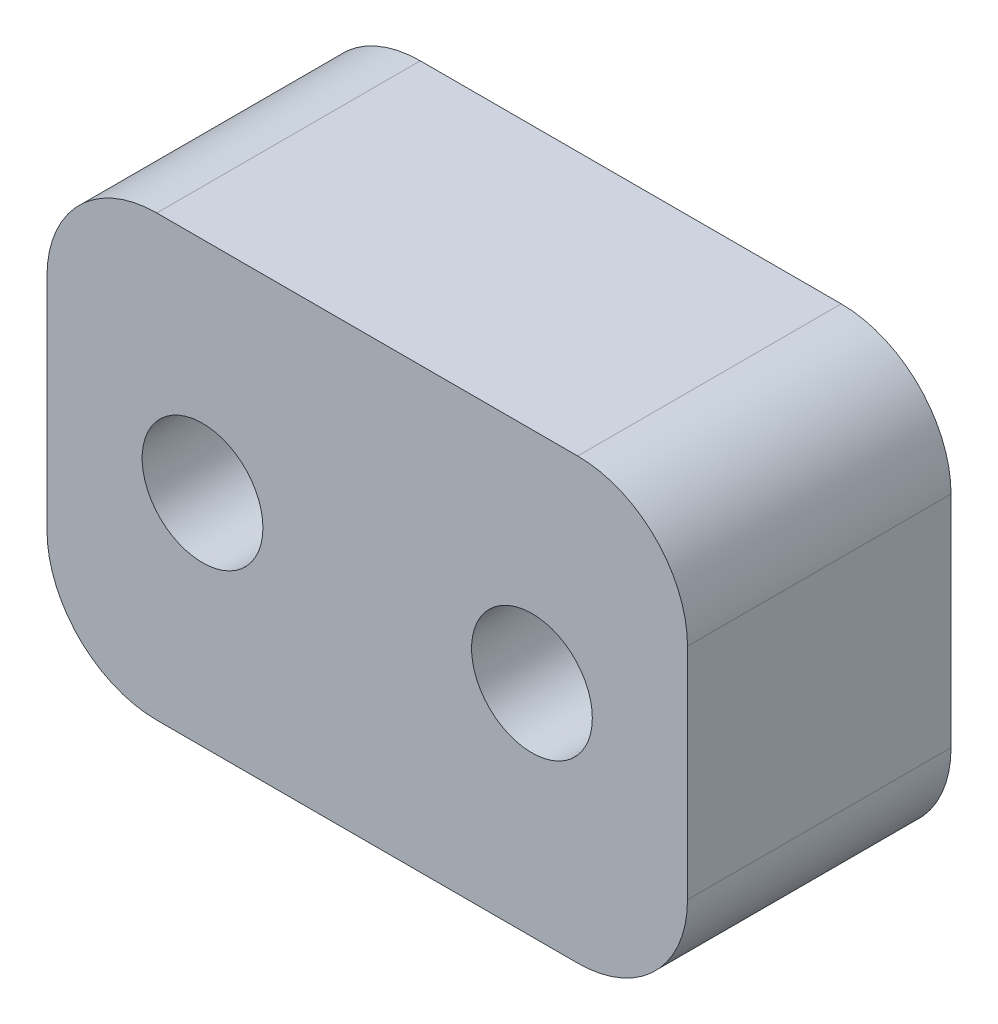
ISO-10303-21;
HEADER;
FILE_DESCRIPTION(('STEP AP214'),'2;1');
FILE_NAME('part.step','',(''),(''),'','','');
FILE_SCHEMA(('AUTOMOTIVE_DESIGN { 1 0 10303 214 1 1 1 1 }'));
ENDSEC;
DATA;
#1=APPLICATION_CONTEXT('core data for automotive mechanical design processes');
#2=APPLICATION_PROTOCOL_DEFINITION('international standard','automotive_design',2000,#1);
#3=PRODUCT_CONTEXT('',#1,'mechanical');
#4=PRODUCT('Part','Part','',(#3));
#5=PRODUCT_RELATED_PRODUCT_CATEGORY('part','',(#4));
#6=PRODUCT_DEFINITION_FORMATION('','',#4);
#7=PRODUCT_DEFINITION_CONTEXT('part definition',#1,'design');
#8=PRODUCT_DEFINITION('design','',#6,#7);
#9=PRODUCT_DEFINITION_SHAPE('','',#8);
#10=(LENGTH_UNIT() NAMED_UNIT(*) SI_UNIT(.MILLI.,.METRE.));
#11=(NAMED_UNIT(*) PLANE_ANGLE_UNIT() SI_UNIT($,.RADIAN.));
#12=(NAMED_UNIT(*) SI_UNIT($,.STERADIAN.) SOLID_ANGLE_UNIT());
#13=UNCERTAINTY_MEASURE_WITH_UNIT(LENGTH_MEASURE(1.E-05),#10,'distance_accuracy_value','');
#14=(GEOMETRIC_REPRESENTATION_CONTEXT(3) GLOBAL_UNCERTAINTY_ASSIGNED_CONTEXT((#13)) GLOBAL_UNIT_ASSIGNED_CONTEXT((#10,
#11,#12)) REPRESENTATION_CONTEXT('',''));
#15=CARTESIAN_POINT('',(0.,0.,0.));
#16=DIRECTION('',(0.,0.,1.));
#17=DIRECTION('',(1.,0.,0.));
#18=AXIS2_PLACEMENT_3D('',#15,#16,#17);
#19=CARTESIAN_POINT('',(-8.75,6.,7.2));
#20=DIRECTION('',(1.,0.,0.));
#21=DIRECTION('',(0.,1.,0.));
#22=AXIS2_PLACEMENT_3D('',#19,#20,#21);
#23=PLANE('',#22);
#24=DIRECTION('',(0.,-1.,0.));
#25=VECTOR('',#24,1.);
#26=CARTESIAN_POINT('',(-8.75,6.,0.));
#27=LINE('',#26,#25);
#28=CARTESIAN_POINT('',(-8.75,3.,0.));
#29=VERTEX_POINT('',#28);
#30=CARTESIAN_POINT('',(-8.75,-3.,0.));
#31=VERTEX_POINT('',#30);
#32=EDGE_CURVE('E165',#29,#31,#27,.T.);
#33=ORIENTED_EDGE('',*,*,#32,.T.);
#34=DIRECTION('',(0.,0.,-1.));
#35=VECTOR('',#34,1.);
#36=CARTESIAN_POINT('',(-8.75,-3.,7.2));
#37=LINE('',#36,#35);
#38=CARTESIAN_POINT('',(-8.75,-3.,7.2));
#39=VERTEX_POINT('',#38);
#40=EDGE_CURVE('E11',#31,#39,#37,.F.);
#41=ORIENTED_EDGE('',*,*,#40,.T.);
#42=DIRECTION('',(0.,-1.,0.));
#43=VECTOR('',#42,1.);
#44=CARTESIAN_POINT('',(-8.75,6.,7.2));
#45=LINE('',#44,#43);
#46=CARTESIAN_POINT('',(-8.75,3.,7.2));
#47=VERTEX_POINT('',#46);
#48=EDGE_CURVE('E133',#47,#39,#45,.T.);
#49=ORIENTED_EDGE('',*,*,#48,.F.);
#50=DIRECTION('',(0.,0.,-1.));
#51=VECTOR('',#50,1.);
#52=CARTESIAN_POINT('',(-8.75,3.,7.2));
#53=LINE('',#52,#51);
#54=EDGE_CURVE('E49',#47,#29,#53,.T.);
#55=ORIENTED_EDGE('',*,*,#54,.T.);
#56=EDGE_LOOP('',(#33,#41,#49,#55));
#57=FACE_BOUND('',#56,.T.);
#58=ADVANCED_FACE('F41',(#57),#23,.F.);
#59=CARTESIAN_POINT('',(-8.75,-6.,7.2));
#60=DIRECTION('',(0.,1.,0.));
#61=DIRECTION('',(0.,0.,1.));
#62=AXIS2_PLACEMENT_3D('',#59,#60,#61);
#63=PLANE('',#62);
#64=DIRECTION('',(1.,0.,0.));
#65=VECTOR('',#64,1.);
#66=CARTESIAN_POINT('',(-8.75,-6.,0.));
#67=LINE('',#66,#65);
#68=CARTESIAN_POINT('',(-5.75,-6.,0.));
#69=VERTEX_POINT('',#68);
#70=CARTESIAN_POINT('',(5.75,-6.,0.));
#71=VERTEX_POINT('',#70);
#72=EDGE_CURVE('E138',#69,#71,#67,.T.);
#73=ORIENTED_EDGE('',*,*,#72,.T.);
#74=DIRECTION('',(0.,0.,-1.));
#75=VECTOR('',#74,1.);
#76=CARTESIAN_POINT('',(5.75,-6.,7.2));
#77=LINE('',#76,#75);
#78=CARTESIAN_POINT('',(5.75,-6.,7.2));
#79=VERTEX_POINT('',#78);
#80=EDGE_CURVE('E56',#71,#79,#77,.F.);
#81=ORIENTED_EDGE('',*,*,#80,.T.);
#82=DIRECTION('',(1.,0.,0.));
#83=VECTOR('',#82,1.);
#84=CARTESIAN_POINT('',(-8.75,-6.,7.2));
#85=LINE('',#84,#83);
#86=CARTESIAN_POINT('',(-5.75,-6.,7.2));
#87=VERTEX_POINT('',#86);
#88=EDGE_CURVE('E136',#87,#79,#85,.T.);
#89=ORIENTED_EDGE('',*,*,#88,.F.);
#90=DIRECTION('',(0.,0.,-1.));
#91=VECTOR('',#90,1.);
#92=CARTESIAN_POINT('',(-5.75,-6.,7.2));
#93=LINE('',#92,#91);
#94=EDGE_CURVE('E157',#87,#69,#93,.T.);
#95=ORIENTED_EDGE('',*,*,#94,.T.);
#96=EDGE_LOOP('',(#73,#81,#89,#95));
#97=FACE_BOUND('',#96,.T.);
#98=ADVANCED_FACE('F204',(#97),#63,.F.);
#99=CARTESIAN_POINT('',(8.75,6.,7.2));
#100=DIRECTION('',(-1.,0.,0.));
#101=DIRECTION('',(0.,0.,1.));
#102=AXIS2_PLACEMENT_3D('',#99,#100,#101);
#103=PLANE('',#102);
#104=DIRECTION('',(0.,1.,0.));
#105=VECTOR('',#104,1.);
#106=CARTESIAN_POINT('',(8.75,6.,0.));
#107=LINE('',#106,#105);
#108=CARTESIAN_POINT('',(8.75,-3.,0.));
#109=VERTEX_POINT('',#108);
#110=CARTESIAN_POINT('',(8.75,3.,0.));
#111=VERTEX_POINT('',#110);
#112=EDGE_CURVE('E134',#109,#111,#107,.T.);
#113=ORIENTED_EDGE('',*,*,#112,.T.);
#114=DIRECTION('',(0.,0.,-1.));
#115=VECTOR('',#114,1.);
#116=CARTESIAN_POINT('',(8.75,3.,7.2));
#117=LINE('',#116,#115);
#118=CARTESIAN_POINT('',(8.75,3.,7.2));
#119=VERTEX_POINT('',#118);
#120=EDGE_CURVE('E112',#111,#119,#117,.F.);
#121=ORIENTED_EDGE('',*,*,#120,.T.);
#122=DIRECTION('',(0.,1.,0.));
#123=VECTOR('',#122,1.);
#124=CARTESIAN_POINT('',(8.75,6.,7.2));
#125=LINE('',#124,#123);
#126=CARTESIAN_POINT('',(8.75,-3.,7.2));
#127=VERTEX_POINT('',#126);
#128=EDGE_CURVE('E177',#127,#119,#125,.T.);
#129=ORIENTED_EDGE('',*,*,#128,.F.);
#130=DIRECTION('',(0.,0.,-1.));
#131=VECTOR('',#130,1.);
#132=CARTESIAN_POINT('',(8.75,-3.,7.2));
#133=LINE('',#132,#131);
#134=EDGE_CURVE('E117',#127,#109,#133,.T.);
#135=ORIENTED_EDGE('',*,*,#134,.T.);
#136=EDGE_LOOP('',(#113,#121,#129,#135));
#137=FACE_BOUND('',#136,.T.);
#138=ADVANCED_FACE('F201',(#137),#103,.F.);
#139=CARTESIAN_POINT('',(-8.75,6.,7.2));
#140=DIRECTION('',(0.,-1.,0.));
#141=DIRECTION('',(0.,0.,-1.));
#142=AXIS2_PLACEMENT_3D('',#139,#140,#141);
#143=PLANE('',#142);
#144=DIRECTION('',(-1.,0.,0.));
#145=VECTOR('',#144,1.);
#146=CARTESIAN_POINT('',(-8.75,6.,7.2));
#147=LINE('',#146,#145);
#148=CARTESIAN_POINT('',(5.75,6.,7.2));
#149=VERTEX_POINT('',#148);
#150=CARTESIAN_POINT('',(-5.75,6.,7.2));
#151=VERTEX_POINT('',#150);
#152=EDGE_CURVE('E127',#149,#151,#147,.T.);
#153=ORIENTED_EDGE('',*,*,#152,.F.);
#154=DIRECTION('',(0.,0.,-1.));
#155=VECTOR('',#154,1.);
#156=CARTESIAN_POINT('',(5.75,6.,7.2));
#157=LINE('',#156,#155);
#158=CARTESIAN_POINT('',(5.75,6.,0.));
#159=VERTEX_POINT('',#158);
#160=EDGE_CURVE('E111',#149,#159,#157,.T.);
#161=ORIENTED_EDGE('',*,*,#160,.T.);
#162=DIRECTION('',(-1.,0.,0.));
#163=VECTOR('',#162,1.);
#164=CARTESIAN_POINT('',(-8.75,6.,0.));
#165=LINE('',#164,#163);
#166=CARTESIAN_POINT('',(-5.75,6.,0.));
#167=VERTEX_POINT('',#166);
#168=EDGE_CURVE('E124',#159,#167,#165,.T.);
#169=ORIENTED_EDGE('',*,*,#168,.T.);
#170=DIRECTION('',(0.,0.,-1.));
#171=VECTOR('',#170,1.);
#172=CARTESIAN_POINT('',(-5.75,6.,7.2));
#173=LINE('',#172,#171);
#174=EDGE_CURVE('E129',#167,#151,#173,.F.);
#175=ORIENTED_EDGE('',*,*,#174,.T.);
#176=EDGE_LOOP('',(#153,#161,#169,#175));
#177=FACE_BOUND('',#176,.T.);
#178=ADVANCED_FACE('F123',(#177),#143,.F.);
#179=CARTESIAN_POINT('',(0.,0.,7.2));
#180=DIRECTION('',(0.,0.,1.));
#181=DIRECTION('',(1.,0.,0.));
#182=AXIS2_PLACEMENT_3D('',#179,#180,#181);
#183=PLANE('',#182);
#184=CARTESIAN_POINT('',(-4.5,0.,7.2));
#185=DIRECTION('',(0.,0.,1.));
#186=DIRECTION('',(1.,0.,0.));
#187=AXIS2_PLACEMENT_3D('',#184,#185,#186);
#188=CIRCLE('',#187,1.65);
#189=CARTESIAN_POINT('',(-2.85,0.,7.2));
#190=VERTEX_POINT('',#189);
#191=EDGE_CURVE('E173',#190,#190,#188,.T.);
#192=ORIENTED_EDGE('',*,*,#191,.F.);
#193=EDGE_LOOP('',(#192));
#194=FACE_BOUND('',#193,.T.);
#195=CARTESIAN_POINT('',(4.5,0.,7.2));
#196=DIRECTION('',(0.,0.,1.));
#197=DIRECTION('',(1.,0.,0.));
#198=AXIS2_PLACEMENT_3D('',#195,#196,#197);
#199=CIRCLE('',#198,1.65);
#200=CARTESIAN_POINT('',(6.15,0.,7.2));
#201=VERTEX_POINT('',#200);
#202=EDGE_CURVE('E184',#201,#201,#199,.T.);
#203=ORIENTED_EDGE('',*,*,#202,.F.);
#204=EDGE_LOOP('',(#203));
#205=FACE_BOUND('',#204,.T.);
#206=ORIENTED_EDGE('',*,*,#128,.T.);
#207=CARTESIAN_POINT('',(5.75,3.,7.2));
#208=DIRECTION('',(0.,0.,1.));
#209=DIRECTION('',(1.,0.,0.));
#210=AXIS2_PLACEMENT_3D('',#207,#208,#209);
#211=CIRCLE('',#210,3.);
#212=EDGE_CURVE('E155',#119,#149,#211,.T.);
#213=ORIENTED_EDGE('',*,*,#212,.T.);
#214=ORIENTED_EDGE('',*,*,#152,.T.);
#215=CARTESIAN_POINT('',(-5.75,3.,7.2));
#216=DIRECTION('',(0.,0.,1.));
#217=DIRECTION('',(1.,0.,0.));
#218=AXIS2_PLACEMENT_3D('',#215,#216,#217);
#219=CIRCLE('',#218,3.);
#220=EDGE_CURVE('E150',#151,#47,#219,.T.);
#221=ORIENTED_EDGE('',*,*,#220,.T.);
#222=ORIENTED_EDGE('',*,*,#48,.T.);
#223=CARTESIAN_POINT('',(-5.75,-3.,7.2));
#224=DIRECTION('',(0.,0.,1.));
#225=DIRECTION('',(1.,0.,0.));
#226=AXIS2_PLACEMENT_3D('',#223,#224,#225);
#227=CIRCLE('',#226,3.);
#228=EDGE_CURVE('E63',#39,#87,#227,.T.);
#229=ORIENTED_EDGE('',*,*,#228,.T.);
#230=ORIENTED_EDGE('',*,*,#88,.T.);
#231=CARTESIAN_POINT('',(5.75,-3.,7.2));
#232=DIRECTION('',(0.,0.,1.));
#233=DIRECTION('',(1.,0.,0.));
#234=AXIS2_PLACEMENT_3D('',#231,#232,#233);
#235=CIRCLE('',#234,3.);
#236=EDGE_CURVE('E153',#79,#127,#235,.T.);
#237=ORIENTED_EDGE('',*,*,#236,.T.);
#238=EDGE_LOOP('',(#206,#213,#214,#221,#222,#229,#230,#237));
#239=FACE_BOUND('',#238,.T.);
#240=ADVANCED_FACE('F192',(#194,#205,#239),#183,.T.);
#241=CARTESIAN_POINT('',(0.,0.,0.));
#242=DIRECTION('',(0.,0.,1.));
#243=DIRECTION('',(1.,0.,0.));
#244=AXIS2_PLACEMENT_3D('',#241,#242,#243);
#245=PLANE('',#244);
#246=CARTESIAN_POINT('',(-4.5,0.,0.));
#247=DIRECTION('',(0.,0.,1.));
#248=DIRECTION('',(1.,0.,0.));
#249=AXIS2_PLACEMENT_3D('',#246,#247,#248);
#250=CIRCLE('',#249,1.65);
#251=CARTESIAN_POINT('',(-2.85,0.,0.));
#252=VERTEX_POINT('',#251);
#253=EDGE_CURVE('E170',#252,#252,#250,.T.);
#254=ORIENTED_EDGE('',*,*,#253,.T.);
#255=EDGE_LOOP('',(#254));
#256=FACE_BOUND('',#255,.T.);
#257=CARTESIAN_POINT('',(4.5,0.,0.));
#258=DIRECTION('',(0.,0.,1.));
#259=DIRECTION('',(1.,0.,0.));
#260=AXIS2_PLACEMENT_3D('',#257,#258,#259);
#261=CIRCLE('',#260,1.65);
#262=CARTESIAN_POINT('',(6.15,0.,0.));
#263=VERTEX_POINT('',#262);
#264=EDGE_CURVE('E181',#263,#263,#261,.T.);
#265=ORIENTED_EDGE('',*,*,#264,.T.);
#266=EDGE_LOOP('',(#265));
#267=FACE_BOUND('',#266,.T.);
#268=ORIENTED_EDGE('',*,*,#168,.F.);
#269=CARTESIAN_POINT('',(5.75,3.,0.));
#270=DIRECTION('',(0.,0.,1.));
#271=DIRECTION('',(1.,0.,0.));
#272=AXIS2_PLACEMENT_3D('',#269,#270,#271);
#273=CIRCLE('',#272,3.);
#274=EDGE_CURVE('E107',#159,#111,#273,.F.);
#275=ORIENTED_EDGE('',*,*,#274,.T.);
#276=ORIENTED_EDGE('',*,*,#112,.F.);
#277=CARTESIAN_POINT('',(5.75,-3.,0.));
#278=DIRECTION('',(0.,0.,1.));
#279=DIRECTION('',(1.,0.,0.));
#280=AXIS2_PLACEMENT_3D('',#277,#278,#279);
#281=CIRCLE('',#280,3.);
#282=EDGE_CURVE('E118',#109,#71,#281,.F.);
#283=ORIENTED_EDGE('',*,*,#282,.T.);
#284=ORIENTED_EDGE('',*,*,#72,.F.);
#285=CARTESIAN_POINT('',(-5.75,-3.,0.));
#286=DIRECTION('',(0.,0.,1.));
#287=DIRECTION('',(1.,0.,0.));
#288=AXIS2_PLACEMENT_3D('',#285,#286,#287);
#289=CIRCLE('',#288,3.);
#290=EDGE_CURVE('E144',#69,#31,#289,.F.);
#291=ORIENTED_EDGE('',*,*,#290,.T.);
#292=ORIENTED_EDGE('',*,*,#32,.F.);
#293=CARTESIAN_POINT('',(-5.75,3.,0.));
#294=DIRECTION('',(0.,0.,1.));
#295=DIRECTION('',(1.,0.,0.));
#296=AXIS2_PLACEMENT_3D('',#293,#294,#295);
#297=CIRCLE('',#296,3.);
#298=EDGE_CURVE('E128',#29,#167,#297,.F.);
#299=ORIENTED_EDGE('',*,*,#298,.T.);
#300=EDGE_LOOP('',(#268,#275,#276,#283,#284,#291,#292,#299));
#301=FACE_BOUND('',#300,.T.);
#302=ADVANCED_FACE('F131',(#256,#267,#301),#245,.F.);
#303=CARTESIAN_POINT('',(5.75,3.,7.2));
#304=DIRECTION('',(0.,0.,-1.));
#305=DIRECTION('',(-1.,0.,0.));
#306=AXIS2_PLACEMENT_3D('',#303,#304,#305);
#307=CYLINDRICAL_SURFACE('',#306,3.);
#308=ORIENTED_EDGE('',*,*,#212,.F.);
#309=ORIENTED_EDGE('',*,*,#120,.F.);
#310=ORIENTED_EDGE('',*,*,#274,.F.);
#311=ORIENTED_EDGE('',*,*,#160,.F.);
#312=EDGE_LOOP('',(#308,#309,#310,#311));
#313=FACE_BOUND('',#312,.T.);
#314=ADVANCED_FACE('F110',(#313),#307,.T.);
#315=CARTESIAN_POINT('',(5.75,-3.,7.2));
#316=DIRECTION('',(0.,0.,-1.));
#317=DIRECTION('',(-1.,0.,0.));
#318=AXIS2_PLACEMENT_3D('',#315,#316,#317);
#319=CYLINDRICAL_SURFACE('',#318,3.);
#320=ORIENTED_EDGE('',*,*,#236,.F.);
#321=ORIENTED_EDGE('',*,*,#80,.F.);
#322=ORIENTED_EDGE('',*,*,#282,.F.);
#323=ORIENTED_EDGE('',*,*,#134,.F.);
#324=EDGE_LOOP('',(#320,#321,#322,#323));
#325=FACE_BOUND('',#324,.T.);
#326=ADVANCED_FACE('F203',(#325),#319,.T.);
#327=CARTESIAN_POINT('',(-5.75,-3.,7.2));
#328=DIRECTION('',(0.,0.,-1.));
#329=DIRECTION('',(-1.,0.,0.));
#330=AXIS2_PLACEMENT_3D('',#327,#328,#329);
#331=CYLINDRICAL_SURFACE('',#330,3.);
#332=ORIENTED_EDGE('',*,*,#228,.F.);
#333=ORIENTED_EDGE('',*,*,#40,.F.);
#334=ORIENTED_EDGE('',*,*,#290,.F.);
#335=ORIENTED_EDGE('',*,*,#94,.F.);
#336=EDGE_LOOP('',(#332,#333,#334,#335));
#337=FACE_BOUND('',#336,.T.);
#338=ADVANCED_FACE('F207',(#337),#331,.T.);
#339=CARTESIAN_POINT('',(-5.75,3.,7.2));
#340=DIRECTION('',(0.,0.,-1.));
#341=DIRECTION('',(-1.,0.,0.));
#342=AXIS2_PLACEMENT_3D('',#339,#340,#341);
#343=CYLINDRICAL_SURFACE('',#342,3.);
#344=ORIENTED_EDGE('',*,*,#220,.F.);
#345=ORIENTED_EDGE('',*,*,#174,.F.);
#346=ORIENTED_EDGE('',*,*,#298,.F.);
#347=ORIENTED_EDGE('',*,*,#54,.F.);
#348=EDGE_LOOP('',(#344,#345,#346,#347));
#349=FACE_BOUND('',#348,.T.);
#350=ADVANCED_FACE('F43',(#349),#343,.T.);
#351=CARTESIAN_POINT('',(4.5,0.,0.));
#352=DIRECTION('',(0.,0.,1.));
#353=DIRECTION('',(1.,0.,0.));
#354=AXIS2_PLACEMENT_3D('',#351,#352,#353);
#355=CYLINDRICAL_SURFACE('',#354,1.65);
#356=ORIENTED_EDGE('',*,*,#264,.F.);
#357=EDGE_LOOP('',(#356));
#358=FACE_BOUND('',#357,.T.);
#359=ORIENTED_EDGE('',*,*,#202,.T.);
#360=EDGE_LOOP('',(#359));
#361=FACE_BOUND('',#360,.T.);
#362=ADVANCED_FACE('F209',(#358,#361),#355,.F.);
#363=CARTESIAN_POINT('',(-4.5,0.,0.));
#364=DIRECTION('',(0.,0.,1.));
#365=DIRECTION('',(1.,0.,0.));
#366=AXIS2_PLACEMENT_3D('',#363,#364,#365);
#367=CYLINDRICAL_SURFACE('',#366,1.65);
#368=ORIENTED_EDGE('',*,*,#253,.F.);
#369=EDGE_LOOP('',(#368));
#370=FACE_BOUND('',#369,.T.);
#371=ORIENTED_EDGE('',*,*,#191,.T.);
#372=EDGE_LOOP('',(#371));
#373=FACE_BOUND('',#372,.T.);
#374=ADVANCED_FACE('F190',(#370,#373),#367,.F.);
#375=CLOSED_SHELL('',(#58,#98,#138,#178,#240,#302,#314,#326,#338,#350,#362,#374));
#376=MANIFOLD_SOLID_BREP('B2',#375);
#377=ADVANCED_BREP_SHAPE_REPRESENTATION('',(#18,#376),#14);
#378=SHAPE_DEFINITION_REPRESENTATION(#9,#377);
ENDSEC;
END-ISO-10303-21;
